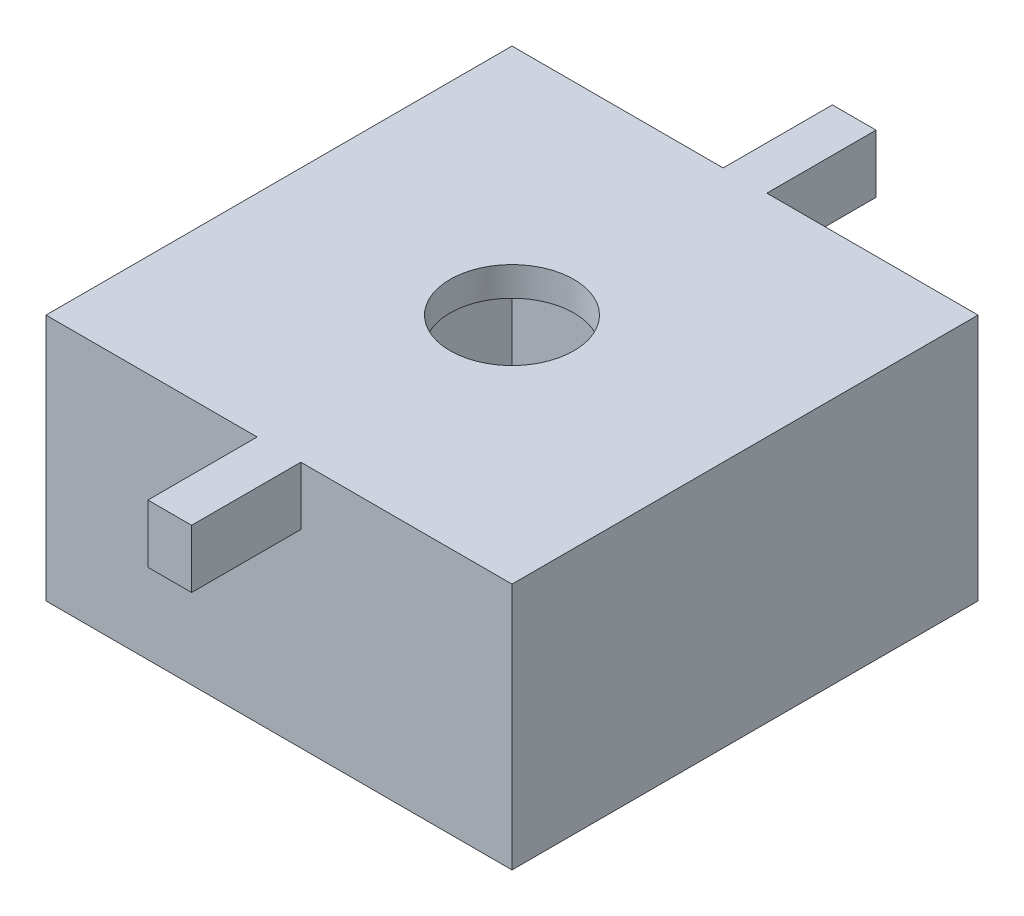
ISO-10303-21;
HEADER;
FILE_DESCRIPTION(('STEP AP214'),'2;1');
FILE_NAME('part.step','',(''),(''),'','','');
FILE_SCHEMA(('AUTOMOTIVE_DESIGN { 1 0 10303 214 1 1 1 1 }'));
ENDSEC;
DATA;
#1=APPLICATION_CONTEXT('core data for automotive mechanical design processes');
#2=APPLICATION_PROTOCOL_DEFINITION('international standard','automotive_design',2000,#1);
#3=PRODUCT_CONTEXT('',#1,'mechanical');
#4=PRODUCT('Part','Part','',(#3));
#5=PRODUCT_RELATED_PRODUCT_CATEGORY('part','',(#4));
#6=PRODUCT_DEFINITION_FORMATION('','',#4);
#7=PRODUCT_DEFINITION_CONTEXT('part definition',#1,'design');
#8=PRODUCT_DEFINITION('design','',#6,#7);
#9=PRODUCT_DEFINITION_SHAPE('','',#8);
#10=(LENGTH_UNIT() NAMED_UNIT(*) SI_UNIT(.MILLI.,.METRE.));
#11=(NAMED_UNIT(*) PLANE_ANGLE_UNIT() SI_UNIT($,.RADIAN.));
#12=(NAMED_UNIT(*) SI_UNIT($,.STERADIAN.) SOLID_ANGLE_UNIT());
#13=UNCERTAINTY_MEASURE_WITH_UNIT(LENGTH_MEASURE(1.E-05),#10,'distance_accuracy_value','');
#14=(GEOMETRIC_REPRESENTATION_CONTEXT(3) GLOBAL_UNCERTAINTY_ASSIGNED_CONTEXT((#13)) GLOBAL_UNIT_ASSIGNED_CONTEXT((#10,
#11,#12)) REPRESENTATION_CONTEXT('',''));
#15=CARTESIAN_POINT('',(0.,0.,0.));
#16=DIRECTION('',(0.,0.,1.));
#17=DIRECTION('',(1.,0.,0.));
#18=AXIS2_PLACEMENT_3D('',#15,#16,#17);
#19=CARTESIAN_POINT('',(16.,15.,-16.));
#20=DIRECTION('',(0.,0.,1.));
#21=DIRECTION('',(1.,0.,0.));
#22=AXIS2_PLACEMENT_3D('',#19,#20,#21);
#23=PLANE('',#22);
#24=DIRECTION('',(0.,-1.,0.));
#25=VECTOR('',#24,1.);
#26=CARTESIAN_POINT('',(1.5,13.,-16.));
#27=LINE('',#26,#25);
#28=CARTESIAN_POINT('',(1.5,17.,-16.));
#29=VERTEX_POINT('',#28);
#30=CARTESIAN_POINT('',(1.5,13.,-16.));
#31=VERTEX_POINT('',#30);
#32=EDGE_CURVE('E159',#29,#31,#27,.T.);
#33=ORIENTED_EDGE('',*,*,#32,.F.);
#34=DIRECTION('',(-1.,0.,0.));
#35=VECTOR('',#34,1.);
#36=CARTESIAN_POINT('',(-16.,17.,-16.));
#37=LINE('',#36,#35);
#38=CARTESIAN_POINT('',(16.,17.,-16.));
#39=VERTEX_POINT('',#38);
#40=EDGE_CURVE('E206',#39,#29,#37,.T.);
#41=ORIENTED_EDGE('',*,*,#40,.F.);
#42=DIRECTION('',(0.,-1.,0.));
#43=VECTOR('',#42,1.);
#44=CARTESIAN_POINT('',(16.,15.,-16.));
#45=LINE('',#44,#43);
#46=CARTESIAN_POINT('',(16.,0.,-16.));
#47=VERTEX_POINT('',#46);
#48=EDGE_CURVE('E11',#39,#47,#45,.T.);
#49=ORIENTED_EDGE('',*,*,#48,.T.);
#50=DIRECTION('',(-1.,0.,0.));
#51=VECTOR('',#50,1.);
#52=CARTESIAN_POINT('',(16.,0.,-16.));
#53=LINE('',#52,#51);
#54=CARTESIAN_POINT('',(-16.,0.,-16.));
#55=VERTEX_POINT('',#54);
#56=EDGE_CURVE('E289',#47,#55,#53,.T.);
#57=ORIENTED_EDGE('',*,*,#56,.T.);
#58=DIRECTION('',(0.,-1.,0.));
#59=VECTOR('',#58,1.);
#60=CARTESIAN_POINT('',(-16.,15.,-16.));
#61=LINE('',#60,#59);
#62=CARTESIAN_POINT('',(-16.,17.,-16.));
#63=VERTEX_POINT('',#62);
#64=EDGE_CURVE('E42',#63,#55,#61,.T.);
#65=ORIENTED_EDGE('',*,*,#64,.F.);
#66=CARTESIAN_POINT('',(-1.5,17.,-16.));
#67=VERTEX_POINT('',#66);
#68=EDGE_CURVE('E211',#67,#63,#37,.T.);
#69=ORIENTED_EDGE('',*,*,#68,.F.);
#70=DIRECTION('',(0.,1.,0.));
#71=VECTOR('',#70,1.);
#72=CARTESIAN_POINT('',(-1.5,13.,-16.));
#73=LINE('',#72,#71);
#74=CARTESIAN_POINT('',(-1.5,13.,-16.));
#75=VERTEX_POINT('',#74);
#76=EDGE_CURVE('E229',#75,#67,#73,.T.);
#77=ORIENTED_EDGE('',*,*,#76,.F.);
#78=DIRECTION('',(-1.,0.,0.));
#79=VECTOR('',#78,1.);
#80=CARTESIAN_POINT('',(-1.5,13.,-16.));
#81=LINE('',#80,#79);
#82=EDGE_CURVE('E58',#31,#75,#81,.T.);
#83=ORIENTED_EDGE('',*,*,#82,.F.);
#84=EDGE_LOOP('',(#33,#41,#49,#57,#65,#69,#77,#83));
#85=FACE_BOUND('',#84,.T.);
#86=ADVANCED_FACE('F33',(#85),#23,.F.);
#87=CARTESIAN_POINT('',(0.,0.,0.));
#88=DIRECTION('',(0.,1.,0.));
#89=DIRECTION('',(0.,0.,1.));
#90=AXIS2_PLACEMENT_3D('',#87,#88,#89);
#91=PLANE('',#90);
#92=DIRECTION('',(0.,0.,-1.));
#93=VECTOR('',#92,1.);
#94=CARTESIAN_POINT('',(16.,0.,16.));
#95=LINE('',#94,#93);
#96=CARTESIAN_POINT('',(16.,0.,16.));
#97=VERTEX_POINT('',#96);
#98=EDGE_CURVE('E286',#97,#47,#95,.T.);
#99=ORIENTED_EDGE('',*,*,#98,.F.);
#100=DIRECTION('',(1.,0.,0.));
#101=VECTOR('',#100,1.);
#102=CARTESIAN_POINT('',(16.,0.,16.));
#103=LINE('',#102,#101);
#104=CARTESIAN_POINT('',(-16.,0.,16.));
#105=VERTEX_POINT('',#104);
#106=EDGE_CURVE('E276',#105,#97,#103,.T.);
#107=ORIENTED_EDGE('',*,*,#106,.F.);
#108=DIRECTION('',(0.,0.,1.));
#109=VECTOR('',#108,1.);
#110=CARTESIAN_POINT('',(-16.,0.,16.));
#111=LINE('',#110,#109);
#112=EDGE_CURVE('E284',#55,#105,#111,.T.);
#113=ORIENTED_EDGE('',*,*,#112,.F.);
#114=ORIENTED_EDGE('',*,*,#56,.F.);
#115=EDGE_LOOP('',(#99,#107,#113,#114));
#116=FACE_BOUND('',#115,.T.);
#117=DIRECTION('',(0.,0.,1.));
#118=VECTOR('',#117,1.);
#119=CARTESIAN_POINT('',(-14.,0.,14.));
#120=LINE('',#119,#118);
#121=CARTESIAN_POINT('',(-14.,0.,-14.));
#122=VERTEX_POINT('',#121);
#123=CARTESIAN_POINT('',(-14.,0.,14.));
#124=VERTEX_POINT('',#123);
#125=EDGE_CURVE('E204',#122,#124,#120,.T.);
#126=ORIENTED_EDGE('',*,*,#125,.T.);
#127=DIRECTION('',(1.,0.,0.));
#128=VECTOR('',#127,1.);
#129=CARTESIAN_POINT('',(14.,0.,14.));
#130=LINE('',#129,#128);
#131=CARTESIAN_POINT('',(14.,0.,14.));
#132=VERTEX_POINT('',#131);
#133=EDGE_CURVE('E315',#124,#132,#130,.T.);
#134=ORIENTED_EDGE('',*,*,#133,.T.);
#135=DIRECTION('',(0.,0.,-1.));
#136=VECTOR('',#135,1.);
#137=CARTESIAN_POINT('',(14.,0.,14.));
#138=LINE('',#137,#136);
#139=CARTESIAN_POINT('',(14.,0.,-14.));
#140=VERTEX_POINT('',#139);
#141=EDGE_CURVE('E312',#132,#140,#138,.T.);
#142=ORIENTED_EDGE('',*,*,#141,.T.);
#143=DIRECTION('',(-1.,0.,0.));
#144=VECTOR('',#143,1.);
#145=CARTESIAN_POINT('',(14.,0.,-14.));
#146=LINE('',#145,#144);
#147=EDGE_CURVE('E309',#140,#122,#146,.T.);
#148=ORIENTED_EDGE('',*,*,#147,.T.);
#149=EDGE_LOOP('',(#126,#134,#142,#148));
#150=FACE_BOUND('',#149,.T.);
#151=ADVANCED_FACE('F282',(#116,#150),#91,.F.);
#152=CARTESIAN_POINT('',(16.,15.,16.));
#153=DIRECTION('',(-1.,0.,0.));
#154=DIRECTION('',(0.,0.,1.));
#155=AXIS2_PLACEMENT_3D('',#152,#153,#154);
#156=PLANE('',#155);
#157=ORIENTED_EDGE('',*,*,#98,.T.);
#158=ORIENTED_EDGE('',*,*,#48,.F.);
#159=DIRECTION('',(0.,0.,-1.));
#160=VECTOR('',#159,1.);
#161=CARTESIAN_POINT('',(16.,17.,16.));
#162=LINE('',#161,#160);
#163=CARTESIAN_POINT('',(16.,17.,16.));
#164=VERTEX_POINT('',#163);
#165=EDGE_CURVE('E248',#164,#39,#162,.T.);
#166=ORIENTED_EDGE('',*,*,#165,.F.);
#167=DIRECTION('',(0.,-1.,0.));
#168=VECTOR('',#167,1.);
#169=CARTESIAN_POINT('',(16.,15.,16.));
#170=LINE('',#169,#168);
#171=EDGE_CURVE('E200',#164,#97,#170,.T.);
#172=ORIENTED_EDGE('',*,*,#171,.T.);
#173=EDGE_LOOP('',(#157,#158,#166,#172));
#174=FACE_BOUND('',#173,.T.);
#175=ADVANCED_FACE('F35',(#174),#156,.F.);
#176=CARTESIAN_POINT('',(-16.,15.,16.));
#177=DIRECTION('',(1.,0.,0.));
#178=DIRECTION('',(0.,0.,-1.));
#179=AXIS2_PLACEMENT_3D('',#176,#177,#178);
#180=PLANE('',#179);
#181=ORIENTED_EDGE('',*,*,#112,.T.);
#182=DIRECTION('',(0.,-1.,0.));
#183=VECTOR('',#182,1.);
#184=CARTESIAN_POINT('',(-16.,15.,16.));
#185=LINE('',#184,#183);
#186=CARTESIAN_POINT('',(-16.,17.,16.));
#187=VERTEX_POINT('',#186);
#188=EDGE_CURVE('E274',#187,#105,#185,.T.);
#189=ORIENTED_EDGE('',*,*,#188,.F.);
#190=DIRECTION('',(0.,0.,1.));
#191=VECTOR('',#190,1.);
#192=CARTESIAN_POINT('',(-16.,17.,16.));
#193=LINE('',#192,#191);
#194=EDGE_CURVE('E203',#63,#187,#193,.T.);
#195=ORIENTED_EDGE('',*,*,#194,.F.);
#196=ORIENTED_EDGE('',*,*,#64,.T.);
#197=EDGE_LOOP('',(#181,#189,#195,#196));
#198=FACE_BOUND('',#197,.T.);
#199=ADVANCED_FACE('F294',(#198),#180,.F.);
#200=CARTESIAN_POINT('',(16.,15.,16.));
#201=DIRECTION('',(0.,0.,-1.));
#202=DIRECTION('',(-1.,0.,0.));
#203=AXIS2_PLACEMENT_3D('',#200,#201,#202);
#204=PLANE('',#203);
#205=DIRECTION('',(1.,0.,0.));
#206=VECTOR('',#205,1.);
#207=CARTESIAN_POINT('',(-16.,17.,16.));
#208=LINE('',#207,#206);
#209=CARTESIAN_POINT('',(1.5,17.,16.));
#210=VERTEX_POINT('',#209);
#211=EDGE_CURVE('E186',#210,#164,#208,.T.);
#212=ORIENTED_EDGE('',*,*,#211,.F.);
#213=DIRECTION('',(0.,-1.,0.));
#214=VECTOR('',#213,1.);
#215=CARTESIAN_POINT('',(1.5,13.,16.));
#216=LINE('',#215,#214);
#217=CARTESIAN_POINT('',(1.5,13.,16.));
#218=VERTEX_POINT('',#217);
#219=EDGE_CURVE('E155',#210,#218,#216,.T.);
#220=ORIENTED_EDGE('',*,*,#219,.T.);
#221=DIRECTION('',(-1.,0.,0.));
#222=VECTOR('',#221,1.);
#223=CARTESIAN_POINT('',(-1.5,13.,16.));
#224=LINE('',#223,#222);
#225=CARTESIAN_POINT('',(-1.5,13.,16.));
#226=VERTEX_POINT('',#225);
#227=EDGE_CURVE('E168',#218,#226,#224,.T.);
#228=ORIENTED_EDGE('',*,*,#227,.T.);
#229=DIRECTION('',(0.,1.,0.));
#230=VECTOR('',#229,1.);
#231=CARTESIAN_POINT('',(-1.5,13.,16.));
#232=LINE('',#231,#230);
#233=CARTESIAN_POINT('',(-1.5,17.,16.));
#234=VERTEX_POINT('',#233);
#235=EDGE_CURVE('E183',#226,#234,#232,.T.);
#236=ORIENTED_EDGE('',*,*,#235,.T.);
#237=EDGE_CURVE('E202',#187,#234,#208,.T.);
#238=ORIENTED_EDGE('',*,*,#237,.F.);
#239=ORIENTED_EDGE('',*,*,#188,.T.);
#240=ORIENTED_EDGE('',*,*,#106,.T.);
#241=ORIENTED_EDGE('',*,*,#171,.F.);
#242=EDGE_LOOP('',(#212,#220,#228,#236,#238,#239,#240,#241));
#243=FACE_BOUND('',#242,.T.);
#244=ADVANCED_FACE('F196',(#243),#204,.F.);
#245=CARTESIAN_POINT('',(-14.,15.,14.));
#246=DIRECTION('',(1.,0.,0.));
#247=DIRECTION('',(0.,0.,-1.));
#248=AXIS2_PLACEMENT_3D('',#245,#246,#247);
#249=PLANE('',#248);
#250=ORIENTED_EDGE('',*,*,#125,.F.);
#251=DIRECTION('',(0.,-1.,0.));
#252=VECTOR('',#251,1.);
#253=CARTESIAN_POINT('',(-14.,15.,-14.));
#254=LINE('',#253,#252);
#255=CARTESIAN_POINT('',(-14.,15.,-14.));
#256=VERTEX_POINT('',#255);
#257=EDGE_CURVE('E305',#256,#122,#254,.T.);
#258=ORIENTED_EDGE('',*,*,#257,.F.);
#259=DIRECTION('',(0.,0.,1.));
#260=VECTOR('',#259,1.);
#261=CARTESIAN_POINT('',(-14.,15.,14.));
#262=LINE('',#261,#260);
#263=CARTESIAN_POINT('',(-14.,15.,14.));
#264=VERTEX_POINT('',#263);
#265=EDGE_CURVE('E218',#256,#264,#262,.T.);
#266=ORIENTED_EDGE('',*,*,#265,.T.);
#267=DIRECTION('',(0.,-1.,0.));
#268=VECTOR('',#267,1.);
#269=CARTESIAN_POINT('',(-14.,15.,14.));
#270=LINE('',#269,#268);
#271=EDGE_CURVE('E296',#264,#124,#270,.T.);
#272=ORIENTED_EDGE('',*,*,#271,.T.);
#273=EDGE_LOOP('',(#250,#258,#266,#272));
#274=FACE_BOUND('',#273,.T.);
#275=ADVANCED_FACE('F332',(#274),#249,.T.);
#276=CARTESIAN_POINT('',(14.,15.,14.));
#277=DIRECTION('',(0.,0.,-1.));
#278=DIRECTION('',(-1.,0.,0.));
#279=AXIS2_PLACEMENT_3D('',#276,#277,#278);
#280=PLANE('',#279);
#281=ORIENTED_EDGE('',*,*,#133,.F.);
#282=ORIENTED_EDGE('',*,*,#271,.F.);
#283=DIRECTION('',(1.,0.,0.));
#284=VECTOR('',#283,1.);
#285=CARTESIAN_POINT('',(14.,15.,14.));
#286=LINE('',#285,#284);
#287=CARTESIAN_POINT('',(14.,15.,14.));
#288=VERTEX_POINT('',#287);
#289=EDGE_CURVE('E324',#264,#288,#286,.T.);
#290=ORIENTED_EDGE('',*,*,#289,.T.);
#291=DIRECTION('',(0.,-1.,0.));
#292=VECTOR('',#291,1.);
#293=CARTESIAN_POINT('',(14.,15.,14.));
#294=LINE('',#293,#292);
#295=EDGE_CURVE('E301',#288,#132,#294,.T.);
#296=ORIENTED_EDGE('',*,*,#295,.T.);
#297=EDGE_LOOP('',(#281,#282,#290,#296));
#298=FACE_BOUND('',#297,.T.);
#299=ADVANCED_FACE('F334',(#298),#280,.T.);
#300=CARTESIAN_POINT('',(14.,15.,14.));
#301=DIRECTION('',(-1.,0.,0.));
#302=DIRECTION('',(0.,0.,1.));
#303=AXIS2_PLACEMENT_3D('',#300,#301,#302);
#304=PLANE('',#303);
#305=ORIENTED_EDGE('',*,*,#141,.F.);
#306=ORIENTED_EDGE('',*,*,#295,.F.);
#307=DIRECTION('',(0.,0.,-1.));
#308=VECTOR('',#307,1.);
#309=CARTESIAN_POINT('',(14.,15.,14.));
#310=LINE('',#309,#308);
#311=CARTESIAN_POINT('',(14.,15.,-14.));
#312=VERTEX_POINT('',#311);
#313=EDGE_CURVE('E322',#288,#312,#310,.T.);
#314=ORIENTED_EDGE('',*,*,#313,.T.);
#315=DIRECTION('',(0.,-1.,0.));
#316=VECTOR('',#315,1.);
#317=CARTESIAN_POINT('',(14.,15.,-14.));
#318=LINE('',#317,#316);
#319=EDGE_CURVE('E303',#312,#140,#318,.T.);
#320=ORIENTED_EDGE('',*,*,#319,.T.);
#321=EDGE_LOOP('',(#305,#306,#314,#320));
#322=FACE_BOUND('',#321,.T.);
#323=ADVANCED_FACE('F342',(#322),#304,.T.);
#324=CARTESIAN_POINT('',(14.,15.,-14.));
#325=DIRECTION('',(0.,0.,1.));
#326=DIRECTION('',(1.,0.,0.));
#327=AXIS2_PLACEMENT_3D('',#324,#325,#326);
#328=PLANE('',#327);
#329=ORIENTED_EDGE('',*,*,#147,.F.);
#330=ORIENTED_EDGE('',*,*,#319,.F.);
#331=DIRECTION('',(-1.,0.,0.));
#332=VECTOR('',#331,1.);
#333=CARTESIAN_POINT('',(14.,15.,-14.));
#334=LINE('',#333,#332);
#335=EDGE_CURVE('E308',#312,#256,#334,.T.);
#336=ORIENTED_EDGE('',*,*,#335,.T.);
#337=ORIENTED_EDGE('',*,*,#257,.T.);
#338=EDGE_LOOP('',(#329,#330,#336,#337));
#339=FACE_BOUND('',#338,.T.);
#340=ADVANCED_FACE('F338',(#339),#328,.T.);
#341=CARTESIAN_POINT('',(0.,15.,0.));
#342=DIRECTION('',(0.,-1.,0.));
#343=DIRECTION('',(0.,0.,-1.));
#344=AXIS2_PLACEMENT_3D('',#341,#342,#343);
#345=PLANE('',#344);
#346=CARTESIAN_POINT('',(0.,15.,0.));
#347=DIRECTION('',(0.,-1.,0.));
#348=DIRECTION('',(0.,0.,-1.));
#349=AXIS2_PLACEMENT_3D('',#346,#347,#348);
#350=CIRCLE('',#349,4.25);
#351=CARTESIAN_POINT('',(0.,15.,-4.25));
#352=VERTEX_POINT('',#351);
#353=EDGE_CURVE('E244',#352,#352,#350,.F.);
#354=ORIENTED_EDGE('',*,*,#353,.T.);
#355=EDGE_LOOP('',(#354));
#356=FACE_BOUND('',#355,.T.);
#357=ORIENTED_EDGE('',*,*,#289,.F.);
#358=ORIENTED_EDGE('',*,*,#265,.F.);
#359=ORIENTED_EDGE('',*,*,#335,.F.);
#360=ORIENTED_EDGE('',*,*,#313,.F.);
#361=EDGE_LOOP('',(#357,#358,#359,#360));
#362=FACE_BOUND('',#361,.T.);
#363=ADVANCED_FACE('F340',(#356,#362),#345,.T.);
#364=CARTESIAN_POINT('',(0.,17.,0.));
#365=DIRECTION('',(0.,-1.,0.));
#366=DIRECTION('',(0.,0.,-1.));
#367=AXIS2_PLACEMENT_3D('',#364,#365,#366);
#368=PLANE('',#367);
#369=CARTESIAN_POINT('',(0.,17.,0.));
#370=DIRECTION('',(0.,1.,0.));
#371=DIRECTION('',(0.,0.,1.));
#372=AXIS2_PLACEMENT_3D('',#369,#370,#371);
#373=CIRCLE('',#372,4.25);
#374=CARTESIAN_POINT('',(0.,17.,4.25));
#375=VERTEX_POINT('',#374);
#376=EDGE_CURVE('E245',#375,#375,#373,.T.);
#377=ORIENTED_EDGE('',*,*,#376,.F.);
#378=EDGE_LOOP('',(#377));
#379=FACE_BOUND('',#378,.T.);
#380=ORIENTED_EDGE('',*,*,#165,.T.);
#381=ORIENTED_EDGE('',*,*,#40,.T.);
#382=DIRECTION('',(0.,0.,1.));
#383=VECTOR('',#382,1.);
#384=CARTESIAN_POINT('',(1.5,17.,-23.5));
#385=LINE('',#384,#383);
#386=CARTESIAN_POINT('',(1.5,17.,-23.5));
#387=VERTEX_POINT('',#386);
#388=EDGE_CURVE('E228',#387,#29,#385,.T.);
#389=ORIENTED_EDGE('',*,*,#388,.F.);
#390=DIRECTION('',(1.,0.,0.));
#391=VECTOR('',#390,1.);
#392=CARTESIAN_POINT('',(-1.5,17.,-23.5));
#393=LINE('',#392,#391);
#394=CARTESIAN_POINT('',(-1.5,17.,-23.5));
#395=VERTEX_POINT('',#394);
#396=EDGE_CURVE('E257',#395,#387,#393,.T.);
#397=ORIENTED_EDGE('',*,*,#396,.F.);
#398=DIRECTION('',(0.,0.,1.));
#399=VECTOR('',#398,1.);
#400=CARTESIAN_POINT('',(-1.5,17.,-23.5));
#401=LINE('',#400,#399);
#402=EDGE_CURVE('E224',#395,#67,#401,.T.);
#403=ORIENTED_EDGE('',*,*,#402,.T.);
#404=ORIENTED_EDGE('',*,*,#68,.T.);
#405=ORIENTED_EDGE('',*,*,#194,.T.);
#406=ORIENTED_EDGE('',*,*,#237,.T.);
#407=DIRECTION('',(0.,0.,-1.));
#408=VECTOR('',#407,1.);
#409=CARTESIAN_POINT('',(-1.5,17.,23.5));
#410=LINE('',#409,#408);
#411=CARTESIAN_POINT('',(-1.5,17.,23.5));
#412=VERTEX_POINT('',#411);
#413=EDGE_CURVE('E50',#412,#234,#410,.T.);
#414=ORIENTED_EDGE('',*,*,#413,.F.);
#415=DIRECTION('',(1.,0.,0.));
#416=VECTOR('',#415,1.);
#417=CARTESIAN_POINT('',(-1.5,17.,23.5));
#418=LINE('',#417,#416);
#419=CARTESIAN_POINT('',(1.5,17.,23.5));
#420=VERTEX_POINT('',#419);
#421=EDGE_CURVE('E165',#412,#420,#418,.T.);
#422=ORIENTED_EDGE('',*,*,#421,.T.);
#423=DIRECTION('',(0.,0.,-1.));
#424=VECTOR('',#423,1.);
#425=CARTESIAN_POINT('',(1.5,17.,23.5));
#426=LINE('',#425,#424);
#427=EDGE_CURVE('E149',#420,#210,#426,.T.);
#428=ORIENTED_EDGE('',*,*,#427,.T.);
#429=ORIENTED_EDGE('',*,*,#211,.T.);
#430=EDGE_LOOP('',(#380,#381,#389,#397,#403,#404,#405,#406,#414,#422,#428,#429));
#431=FACE_BOUND('',#430,.T.);
#432=ADVANCED_FACE('F171',(#379,#431),#368,.F.);
#433=CARTESIAN_POINT('',(0.,-0.001000000000001,0.));
#434=DIRECTION('',(0.,1.,0.));
#435=DIRECTION('',(0.,0.,1.));
#436=AXIS2_PLACEMENT_3D('',#433,#434,#435);
#437=CYLINDRICAL_SURFACE('',#436,4.25);
#438=ORIENTED_EDGE('',*,*,#353,.F.);
#439=EDGE_LOOP('',(#438));
#440=FACE_BOUND('',#439,.T.);
#441=ORIENTED_EDGE('',*,*,#376,.T.);
#442=EDGE_LOOP('',(#441));
#443=FACE_BOUND('',#442,.T.);
#444=ADVANCED_FACE('F400',(#440,#443),#437,.F.);
#445=CARTESIAN_POINT('',(1.5,13.,-23.5));
#446=DIRECTION('',(-1.,0.,0.));
#447=DIRECTION('',(0.,0.,1.));
#448=AXIS2_PLACEMENT_3D('',#445,#446,#447);
#449=PLANE('',#448);
#450=ORIENTED_EDGE('',*,*,#32,.T.);
#451=DIRECTION('',(0.,0.,1.));
#452=VECTOR('',#451,1.);
#453=CARTESIAN_POINT('',(1.5,13.,-23.5));
#454=LINE('',#453,#452);
#455=CARTESIAN_POINT('',(1.5,13.,-23.5));
#456=VERTEX_POINT('',#455);
#457=EDGE_CURVE('E242',#456,#31,#454,.T.);
#458=ORIENTED_EDGE('',*,*,#457,.F.);
#459=DIRECTION('',(0.,-1.,0.));
#460=VECTOR('',#459,1.);
#461=CARTESIAN_POINT('',(1.5,13.,-23.5));
#462=LINE('',#461,#460);
#463=EDGE_CURVE('E233',#387,#456,#462,.T.);
#464=ORIENTED_EDGE('',*,*,#463,.F.);
#465=ORIENTED_EDGE('',*,*,#388,.T.);
#466=EDGE_LOOP('',(#450,#458,#464,#465));
#467=FACE_BOUND('',#466,.T.);
#468=ADVANCED_FACE('F403',(#467),#449,.F.);
#469=CARTESIAN_POINT('',(-1.5,13.,-23.5));
#470=DIRECTION('',(0.,1.,0.));
#471=DIRECTION('',(0.,0.,1.));
#472=AXIS2_PLACEMENT_3D('',#469,#470,#471);
#473=PLANE('',#472);
#474=ORIENTED_EDGE('',*,*,#82,.T.);
#475=DIRECTION('',(0.,0.,1.));
#476=VECTOR('',#475,1.);
#477=CARTESIAN_POINT('',(-1.5,13.,-23.5));
#478=LINE('',#477,#476);
#479=CARTESIAN_POINT('',(-1.5,13.,-23.5));
#480=VERTEX_POINT('',#479);
#481=EDGE_CURVE('E227',#480,#75,#478,.T.);
#482=ORIENTED_EDGE('',*,*,#481,.F.);
#483=DIRECTION('',(-1.,0.,0.));
#484=VECTOR('',#483,1.);
#485=CARTESIAN_POINT('',(-1.5,13.,-23.5));
#486=LINE('',#485,#484);
#487=EDGE_CURVE('E265',#456,#480,#486,.T.);
#488=ORIENTED_EDGE('',*,*,#487,.F.);
#489=ORIENTED_EDGE('',*,*,#457,.T.);
#490=EDGE_LOOP('',(#474,#482,#488,#489));
#491=FACE_BOUND('',#490,.T.);
#492=ADVANCED_FACE('F425',(#491),#473,.F.);
#493=CARTESIAN_POINT('',(-1.5,13.,-23.5));
#494=DIRECTION('',(1.,0.,0.));
#495=DIRECTION('',(0.,0.,-1.));
#496=AXIS2_PLACEMENT_3D('',#493,#494,#495);
#497=PLANE('',#496);
#498=ORIENTED_EDGE('',*,*,#76,.T.);
#499=ORIENTED_EDGE('',*,*,#402,.F.);
#500=DIRECTION('',(0.,1.,0.));
#501=VECTOR('',#500,1.);
#502=CARTESIAN_POINT('',(-1.5,13.,-23.5));
#503=LINE('',#502,#501);
#504=EDGE_CURVE('E261',#480,#395,#503,.T.);
#505=ORIENTED_EDGE('',*,*,#504,.F.);
#506=ORIENTED_EDGE('',*,*,#481,.T.);
#507=EDGE_LOOP('',(#498,#499,#505,#506));
#508=FACE_BOUND('',#507,.T.);
#509=ADVANCED_FACE('F432',(#508),#497,.F.);
#510=CARTESIAN_POINT('',(0.,0.,-23.5));
#511=DIRECTION('',(0.,0.,-1.));
#512=DIRECTION('',(-1.,0.,0.));
#513=AXIS2_PLACEMENT_3D('',#510,#511,#512);
#514=PLANE('',#513);
#515=ORIENTED_EDGE('',*,*,#463,.T.);
#516=ORIENTED_EDGE('',*,*,#487,.T.);
#517=ORIENTED_EDGE('',*,*,#504,.T.);
#518=ORIENTED_EDGE('',*,*,#396,.T.);
#519=EDGE_LOOP('',(#515,#516,#517,#518));
#520=FACE_BOUND('',#519,.T.);
#521=ADVANCED_FACE('F440',(#520),#514,.T.);
#522=CARTESIAN_POINT('',(1.5,13.,23.5));
#523=DIRECTION('',(1.,0.,0.));
#524=DIRECTION('',(0.,0.,-1.));
#525=AXIS2_PLACEMENT_3D('',#522,#523,#524);
#526=PLANE('',#525);
#527=ORIENTED_EDGE('',*,*,#219,.F.);
#528=ORIENTED_EDGE('',*,*,#427,.F.);
#529=DIRECTION('',(0.,-1.,0.));
#530=VECTOR('',#529,1.);
#531=CARTESIAN_POINT('',(1.5,13.,23.5));
#532=LINE('',#531,#530);
#533=CARTESIAN_POINT('',(1.5,13.,23.5));
#534=VERTEX_POINT('',#533);
#535=EDGE_CURVE('E152',#420,#534,#532,.T.);
#536=ORIENTED_EDGE('',*,*,#535,.T.);
#537=DIRECTION('',(0.,0.,-1.));
#538=VECTOR('',#537,1.);
#539=CARTESIAN_POINT('',(1.5,13.,23.5));
#540=LINE('',#539,#538);
#541=EDGE_CURVE('E178',#534,#218,#540,.T.);
#542=ORIENTED_EDGE('',*,*,#541,.T.);
#543=EDGE_LOOP('',(#527,#528,#536,#542));
#544=FACE_BOUND('',#543,.T.);
#545=ADVANCED_FACE('F151',(#544),#526,.T.);
#546=CARTESIAN_POINT('',(-1.5,13.,23.5));
#547=DIRECTION('',(-1.,0.,0.));
#548=DIRECTION('',(0.,0.,1.));
#549=AXIS2_PLACEMENT_3D('',#546,#547,#548);
#550=PLANE('',#549);
#551=ORIENTED_EDGE('',*,*,#235,.F.);
#552=DIRECTION('',(0.,0.,-1.));
#553=VECTOR('',#552,1.);
#554=CARTESIAN_POINT('',(-1.5,13.,23.5));
#555=LINE('',#554,#553);
#556=CARTESIAN_POINT('',(-1.5,13.,23.5));
#557=VERTEX_POINT('',#556);
#558=EDGE_CURVE('E190',#557,#226,#555,.T.);
#559=ORIENTED_EDGE('',*,*,#558,.F.);
#560=DIRECTION('',(0.,1.,0.));
#561=VECTOR('',#560,1.);
#562=CARTESIAN_POINT('',(-1.5,13.,23.5));
#563=LINE('',#562,#561);
#564=EDGE_CURVE('E173',#557,#412,#563,.T.);
#565=ORIENTED_EDGE('',*,*,#564,.T.);
#566=ORIENTED_EDGE('',*,*,#413,.T.);
#567=EDGE_LOOP('',(#551,#559,#565,#566));
#568=FACE_BOUND('',#567,.T.);
#569=ADVANCED_FACE('F272',(#568),#550,.T.);
#570=CARTESIAN_POINT('',(-1.5,13.,23.5));
#571=DIRECTION('',(0.,-1.,0.));
#572=DIRECTION('',(0.,0.,-1.));
#573=AXIS2_PLACEMENT_3D('',#570,#571,#572);
#574=PLANE('',#573);
#575=ORIENTED_EDGE('',*,*,#227,.F.);
#576=ORIENTED_EDGE('',*,*,#541,.F.);
#577=DIRECTION('',(-1.,0.,0.));
#578=VECTOR('',#577,1.);
#579=CARTESIAN_POINT('',(-1.5,13.,23.5));
#580=LINE('',#579,#578);
#581=EDGE_CURVE('E167',#534,#557,#580,.T.);
#582=ORIENTED_EDGE('',*,*,#581,.T.);
#583=ORIENTED_EDGE('',*,*,#558,.T.);
#584=EDGE_LOOP('',(#575,#576,#582,#583));
#585=FACE_BOUND('',#584,.T.);
#586=ADVANCED_FACE('F271',(#585),#574,.T.);
#587=CARTESIAN_POINT('',(0.,0.,23.5));
#588=DIRECTION('',(0.,0.,1.));
#589=DIRECTION('',(-1.,0.,0.));
#590=AXIS2_PLACEMENT_3D('',#587,#588,#589);
#591=PLANE('',#590);
#592=ORIENTED_EDGE('',*,*,#535,.F.);
#593=ORIENTED_EDGE('',*,*,#421,.F.);
#594=ORIENTED_EDGE('',*,*,#564,.F.);
#595=ORIENTED_EDGE('',*,*,#581,.F.);
#596=EDGE_LOOP('',(#592,#593,#594,#595));
#597=FACE_BOUND('',#596,.T.);
#598=ADVANCED_FACE('F163',(#597),#591,.T.);
#599=CLOSED_SHELL('',(#86,#151,#175,#199,#244,#275,#299,#323,#340,#363,#432,#444,#468,#492,#509,
#521,#545,#569,#586,#598));
#600=MANIFOLD_SOLID_BREP('B2',#599);
#601=ADVANCED_BREP_SHAPE_REPRESENTATION('',(#18,#600),#14);
#602=SHAPE_DEFINITION_REPRESENTATION(#9,#601);
ENDSEC;
END-ISO-10303-21;
